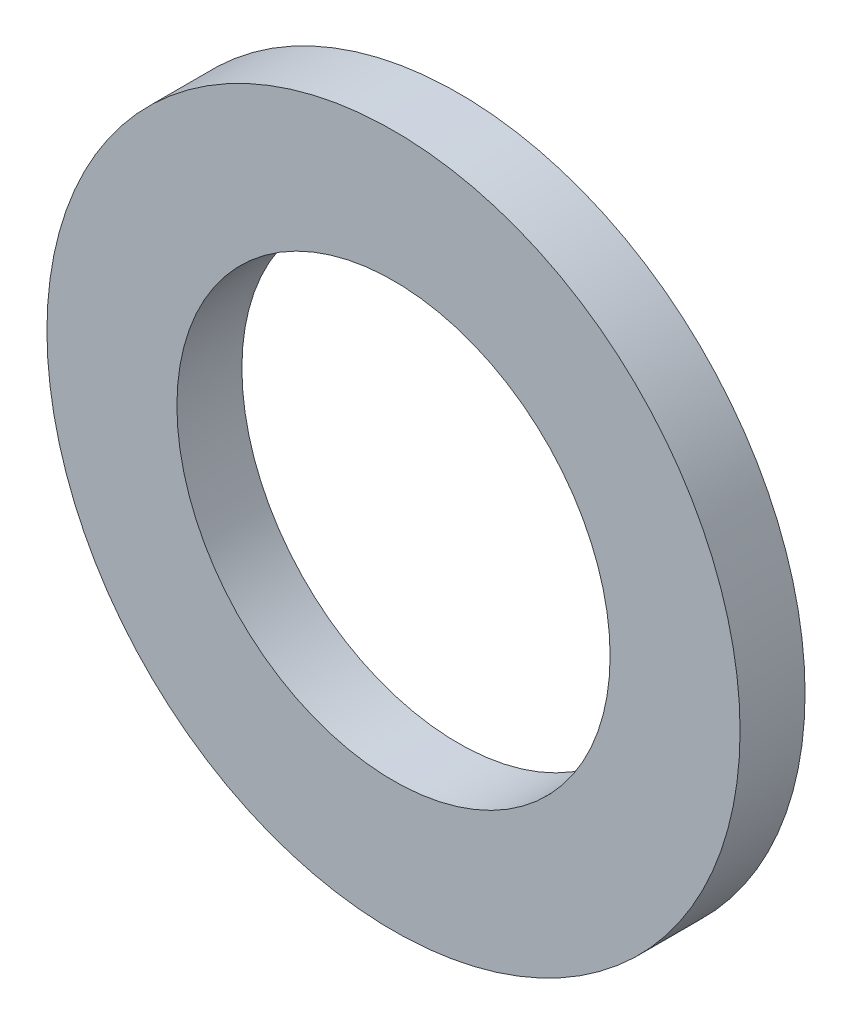
ISO-10303-21;
HEADER;
FILE_DESCRIPTION(('STEP AP214'),'2;1');
FILE_NAME('part.step','',(''),(''),'','','');
FILE_SCHEMA(('AUTOMOTIVE_DESIGN { 1 0 10303 214 1 1 1 1 }'));
ENDSEC;
DATA;
#1=APPLICATION_CONTEXT('core data for automotive mechanical design processes');
#2=APPLICATION_PROTOCOL_DEFINITION('international standard','automotive_design',2000,#1);
#3=PRODUCT_CONTEXT('',#1,'mechanical');
#4=PRODUCT('Part','Part','',(#3));
#5=PRODUCT_RELATED_PRODUCT_CATEGORY('part','',(#4));
#6=PRODUCT_DEFINITION_FORMATION('','',#4);
#7=PRODUCT_DEFINITION_CONTEXT('part definition',#1,'design');
#8=PRODUCT_DEFINITION('design','',#6,#7);
#9=PRODUCT_DEFINITION_SHAPE('','',#8);
#10=(LENGTH_UNIT() NAMED_UNIT(*) SI_UNIT(.MILLI.,.METRE.));
#11=(NAMED_UNIT(*) PLANE_ANGLE_UNIT() SI_UNIT($,.RADIAN.));
#12=(NAMED_UNIT(*) SI_UNIT($,.STERADIAN.) SOLID_ANGLE_UNIT());
#13=UNCERTAINTY_MEASURE_WITH_UNIT(LENGTH_MEASURE(1.E-05),#10,'distance_accuracy_value','');
#14=(GEOMETRIC_REPRESENTATION_CONTEXT(3) GLOBAL_UNCERTAINTY_ASSIGNED_CONTEXT((#13)) GLOBAL_UNIT_ASSIGNED_CONTEXT((#10,
#11,#12)) REPRESENTATION_CONTEXT('',''));
#15=CARTESIAN_POINT('',(0.,0.,0.));
#16=DIRECTION('',(0.,0.,1.));
#17=DIRECTION('',(1.,0.,0.));
#18=AXIS2_PLACEMENT_3D('',#15,#16,#17);
#19=CARTESIAN_POINT('',(0.,0.,0.));
#20=DIRECTION('',(0.,0.,1.));
#21=DIRECTION('',(1.,0.,0.));
#22=AXIS2_PLACEMENT_3D('',#19,#20,#21);
#23=PLANE('',#22);
#24=CARTESIAN_POINT('',(0.,0.,0.));
#25=DIRECTION('',(0.,0.,1.));
#26=DIRECTION('',(1.,0.,0.));
#27=AXIS2_PLACEMENT_3D('',#24,#25,#26);
#28=CIRCLE('',#27,5.);
#29=CARTESIAN_POINT('',(5.,0.,0.));
#30=VERTEX_POINT('',#29);
#31=EDGE_CURVE('E27',#30,#30,#28,.T.);
#32=ORIENTED_EDGE('',*,*,#31,.T.);
#33=EDGE_LOOP('',(#32));
#34=FACE_BOUND('',#33,.T.);
#35=CARTESIAN_POINT('',(0.,0.,0.));
#36=DIRECTION('',(0.,0.,1.));
#37=DIRECTION('',(1.,0.,0.));
#38=AXIS2_PLACEMENT_3D('',#35,#36,#37);
#39=CIRCLE('',#38,8.);
#40=CARTESIAN_POINT('',(8.,0.,0.));
#41=VERTEX_POINT('',#40);
#42=EDGE_CURVE('E18',#41,#41,#39,.T.);
#43=ORIENTED_EDGE('',*,*,#42,.F.);
#44=EDGE_LOOP('',(#43));
#45=FACE_BOUND('',#44,.T.);
#46=ADVANCED_FACE('F15',(#34,#45),#23,.F.);
#47=CARTESIAN_POINT('',(0.,0.,0.));
#48=DIRECTION('',(0.,0.,1.));
#49=DIRECTION('',(1.,0.,0.));
#50=AXIS2_PLACEMENT_3D('',#47,#48,#49);
#51=CYLINDRICAL_SURFACE('',#50,8.);
#52=ORIENTED_EDGE('',*,*,#42,.T.);
#53=EDGE_LOOP('',(#52));
#54=FACE_BOUND('',#53,.T.);
#55=CARTESIAN_POINT('',(0.,0.,1.5));
#56=DIRECTION('',(0.,0.,1.));
#57=DIRECTION('',(1.,0.,0.));
#58=AXIS2_PLACEMENT_3D('',#55,#56,#57);
#59=CIRCLE('',#58,8.);
#60=CARTESIAN_POINT('',(8.,0.,1.5));
#61=VERTEX_POINT('',#60);
#62=EDGE_CURVE('E22',#61,#61,#59,.T.);
#63=ORIENTED_EDGE('',*,*,#62,.F.);
#64=EDGE_LOOP('',(#63));
#65=FACE_BOUND('',#64,.T.);
#66=ADVANCED_FACE('F35',(#54,#65),#51,.T.);
#67=CARTESIAN_POINT('',(0.,0.,0.));
#68=DIRECTION('',(0.,0.,1.));
#69=DIRECTION('',(1.,0.,0.));
#70=AXIS2_PLACEMENT_3D('',#67,#68,#69);
#71=CYLINDRICAL_SURFACE('',#70,5.);
#72=CARTESIAN_POINT('',(0.,0.,1.5));
#73=DIRECTION('',(0.,0.,1.));
#74=DIRECTION('',(1.,0.,0.));
#75=AXIS2_PLACEMENT_3D('',#72,#73,#74);
#76=CIRCLE('',#75,5.);
#77=CARTESIAN_POINT('',(5.,0.,1.5));
#78=VERTEX_POINT('',#77);
#79=EDGE_CURVE('E10',#78,#78,#76,.F.);
#80=ORIENTED_EDGE('',*,*,#79,.F.);
#81=EDGE_LOOP('',(#80));
#82=FACE_BOUND('',#81,.T.);
#83=ORIENTED_EDGE('',*,*,#31,.F.);
#84=EDGE_LOOP('',(#83));
#85=FACE_BOUND('',#84,.T.);
#86=ADVANCED_FACE('F43',(#82,#85),#71,.F.);
#87=CARTESIAN_POINT('',(0.,0.,1.5));
#88=DIRECTION('',(0.,0.,1.));
#89=DIRECTION('',(1.,0.,0.));
#90=AXIS2_PLACEMENT_3D('',#87,#88,#89);
#91=PLANE('',#90);
#92=ORIENTED_EDGE('',*,*,#79,.T.);
#93=EDGE_LOOP('',(#92));
#94=FACE_BOUND('',#93,.T.);
#95=ORIENTED_EDGE('',*,*,#62,.T.);
#96=EDGE_LOOP('',(#95));
#97=FACE_BOUND('',#96,.T.);
#98=ADVANCED_FACE('F44',(#94,#97),#91,.T.);
#99=CLOSED_SHELL('',(#46,#66,#86,#98));
#100=MANIFOLD_SOLID_BREP('B1',#99);
#101=ADVANCED_BREP_SHAPE_REPRESENTATION('',(#18,#100),#14);
#102=SHAPE_DEFINITION_REPRESENTATION(#9,#101);
ENDSEC;
END-ISO-10303-21;
